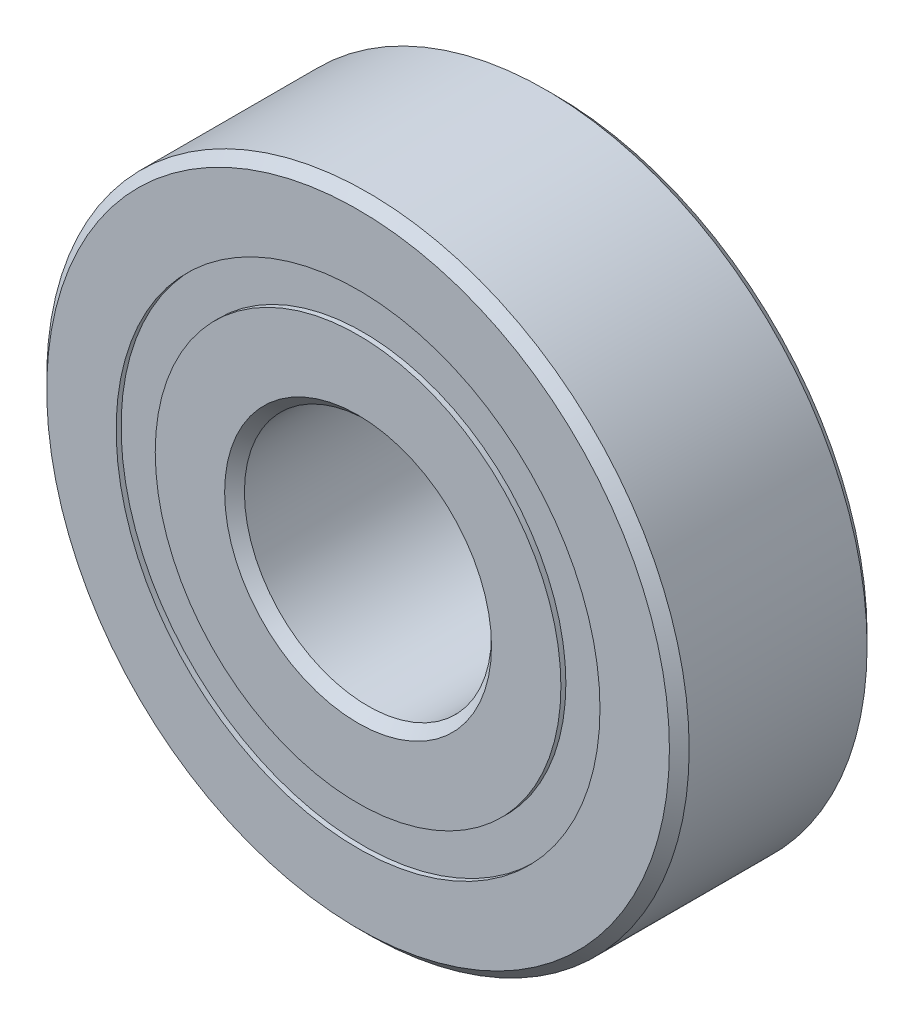
ISO-10303-21;
HEADER;
FILE_DESCRIPTION(('STEP AP214'),'2;1');
FILE_NAME('part.step','',(''),(''),'','','');
FILE_SCHEMA(('AUTOMOTIVE_DESIGN { 1 0 10303 214 1 1 1 1 }'));
ENDSEC;
DATA;
#1=APPLICATION_CONTEXT('core data for automotive mechanical design processes');
#2=APPLICATION_PROTOCOL_DEFINITION('international standard','automotive_design',2000,#1);
#3=PRODUCT_CONTEXT('',#1,'mechanical');
#4=PRODUCT('Part','Part','',(#3));
#5=PRODUCT_RELATED_PRODUCT_CATEGORY('part','',(#4));
#6=PRODUCT_DEFINITION_FORMATION('','',#4);
#7=PRODUCT_DEFINITION_CONTEXT('part definition',#1,'design');
#8=PRODUCT_DEFINITION('design','',#6,#7);
#9=PRODUCT_DEFINITION_SHAPE('','',#8);
#10=(LENGTH_UNIT() NAMED_UNIT(*) SI_UNIT(.MILLI.,.METRE.));
#11=(NAMED_UNIT(*) PLANE_ANGLE_UNIT() SI_UNIT($,.RADIAN.));
#12=(NAMED_UNIT(*) SI_UNIT($,.STERADIAN.) SOLID_ANGLE_UNIT());
#13=UNCERTAINTY_MEASURE_WITH_UNIT(LENGTH_MEASURE(1.E-05),#10,'distance_accuracy_value','');
#14=(GEOMETRIC_REPRESENTATION_CONTEXT(3) GLOBAL_UNCERTAINTY_ASSIGNED_CONTEXT((#13)) GLOBAL_UNIT_ASSIGNED_CONTEXT((#10,
#11,#12)) REPRESENTATION_CONTEXT('',''));
#15=CARTESIAN_POINT('',(0.,0.,0.));
#16=DIRECTION('',(0.,0.,1.));
#17=DIRECTION('',(1.,0.,0.));
#18=AXIS2_PLACEMENT_3D('',#15,#16,#17);
#19=CARTESIAN_POINT('',(0.,9.79,4.));
#20=DIRECTION('',(0.,0.,-1.));
#21=DIRECTION('',(-1.,0.,0.));
#22=AXIS2_PLACEMENT_3D('',#19,#20,#21);
#23=PLANE('',#22);
#24=CARTESIAN_POINT('',(0.,0.,4.));
#25=DIRECTION('',(0.,0.,1.));
#26=DIRECTION('',(1.,0.,0.));
#27=AXIS2_PLACEMENT_3D('',#24,#25,#26);
#28=CIRCLE('',#27,9.79);
#29=CARTESIAN_POINT('',(9.79,0.,4.));
#30=VERTEX_POINT('',#29);
#31=EDGE_CURVE('E11',#30,#30,#28,.T.);
#32=ORIENTED_EDGE('',*,*,#31,.F.);
#33=EDGE_LOOP('',(#32));
#34=FACE_BOUND('',#33,.T.);
#35=CARTESIAN_POINT('',(0.,0.,4.));
#36=DIRECTION('',(0.,0.,1.));
#37=DIRECTION('',(1.,0.,0.));
#38=AXIS2_PLACEMENT_3D('',#35,#36,#37);
#39=CIRCLE('',#38,12.6);
#40=CARTESIAN_POINT('',(12.6,0.,4.));
#41=VERTEX_POINT('',#40);
#42=EDGE_CURVE('E79',#41,#41,#39,.T.);
#43=ORIENTED_EDGE('',*,*,#42,.T.);
#44=EDGE_LOOP('',(#43));
#45=FACE_BOUND('',#44,.T.);
#46=ADVANCED_FACE('F39',(#34,#45),#23,.F.);
#47=CARTESIAN_POINT('',(0.,0.,4.));
#48=DIRECTION('',(0.,0.,1.));
#49=DIRECTION('',(1.,0.,0.));
#50=AXIS2_PLACEMENT_3D('',#47,#48,#49);
#51=CYLINDRICAL_SURFACE('',#50,9.79);
#52=CARTESIAN_POINT('',(0.,0.,3.8));
#53=DIRECTION('',(0.,0.,1.));
#54=DIRECTION('',(1.,0.,0.));
#55=AXIS2_PLACEMENT_3D('',#52,#53,#54);
#56=CIRCLE('',#55,9.79);
#57=CARTESIAN_POINT('',(9.79,0.,3.8));
#58=VERTEX_POINT('',#57);
#59=EDGE_CURVE('E45',#58,#58,#56,.T.);
#60=ORIENTED_EDGE('',*,*,#59,.F.);
#61=EDGE_LOOP('',(#60));
#62=FACE_BOUND('',#61,.T.);
#63=ORIENTED_EDGE('',*,*,#31,.T.);
#64=EDGE_LOOP('',(#63));
#65=FACE_BOUND('',#64,.T.);
#66=ADVANCED_FACE('F140',(#62,#65),#51,.F.);
#67=CARTESIAN_POINT('',(0.,8.21,3.8));
#68=DIRECTION('',(0.,0.,-1.));
#69=DIRECTION('',(-1.,0.,0.));
#70=AXIS2_PLACEMENT_3D('',#67,#68,#69);
#71=PLANE('',#70);
#72=CARTESIAN_POINT('',(0.,0.,3.8));
#73=DIRECTION('',(0.,0.,1.));
#74=DIRECTION('',(1.,0.,0.));
#75=AXIS2_PLACEMENT_3D('',#72,#73,#74);
#76=CIRCLE('',#75,8.21);
#77=CARTESIAN_POINT('',(8.21,0.,3.8));
#78=VERTEX_POINT('',#77);
#79=EDGE_CURVE('E49',#78,#78,#76,.T.);
#80=ORIENTED_EDGE('',*,*,#79,.F.);
#81=EDGE_LOOP('',(#80));
#82=FACE_BOUND('',#81,.T.);
#83=ORIENTED_EDGE('',*,*,#59,.T.);
#84=EDGE_LOOP('',(#83));
#85=FACE_BOUND('',#84,.T.);
#86=ADVANCED_FACE('F135',(#82,#85),#71,.F.);
#87=CARTESIAN_POINT('',(0.,0.,4.));
#88=DIRECTION('',(0.,0.,1.));
#89=DIRECTION('',(1.,0.,0.));
#90=AXIS2_PLACEMENT_3D('',#87,#88,#89);
#91=CYLINDRICAL_SURFACE('',#90,8.21);
#92=CARTESIAN_POINT('',(0.,0.,1.94589444175334));
#93=DIRECTION('',(0.,0.,1.));
#94=DIRECTION('',(1.,0.,0.));
#95=AXIS2_PLACEMENT_3D('',#92,#93,#94);
#96=CIRCLE('',#95,8.21);
#97=CARTESIAN_POINT('',(8.21,0.,1.94589444175334));
#98=VERTEX_POINT('',#97);
#99=EDGE_CURVE('E53',#98,#98,#96,.T.);
#100=ORIENTED_EDGE('',*,*,#99,.F.);
#101=EDGE_LOOP('',(#100));
#102=FACE_BOUND('',#101,.T.);
#103=ORIENTED_EDGE('',*,*,#79,.T.);
#104=EDGE_LOOP('',(#103));
#105=FACE_BOUND('',#104,.T.);
#106=ADVANCED_FACE('F129',(#102,#105),#91,.F.);
#107=CARTESIAN_POINT('',(0.,9.12647063514285,1.94589444175334));
#108=DIRECTION('',(0.,0.,1.));
#109=DIRECTION('',(1.,0.,0.));
#110=AXIS2_PLACEMENT_3D('',#107,#108,#109);
#111=PLANE('',#110);
#112=CARTESIAN_POINT('',(0.,0.,1.94589444175334));
#113=DIRECTION('',(0.,0.,1.));
#114=DIRECTION('',(1.,0.,0.));
#115=AXIS2_PLACEMENT_3D('',#112,#113,#114);
#116=CIRCLE('',#115,9.12647063514285);
#117=CARTESIAN_POINT('',(9.12647063514285,0.,1.94589444175334));
#118=VERTEX_POINT('',#117);
#119=EDGE_CURVE('E58',#118,#118,#116,.T.);
#120=ORIENTED_EDGE('',*,*,#119,.F.);
#121=EDGE_LOOP('',(#120));
#122=FACE_BOUND('',#121,.T.);
#123=ORIENTED_EDGE('',*,*,#99,.T.);
#124=EDGE_LOOP('',(#123));
#125=FACE_BOUND('',#124,.T.);
#126=ADVANCED_FACE('F123',(#122,#125),#111,.F.);
#127=CARTESIAN_POINT('',(0.,0.,0.));
#128=DIRECTION('',(0.,0.,1.));
#129=DIRECTION('',(1.,0.,0.));
#130=AXIS2_PLACEMENT_3D('',#127,#128,#129);
#131=TOROIDAL_SURFACE('',#130,9.,1.95);
#132=CARTESIAN_POINT('',(0.,0.,-1.94589444175335));
#133=DIRECTION('',(0.,0.,1.));
#134=DIRECTION('',(1.,0.,0.));
#135=AXIS2_PLACEMENT_3D('',#132,#133,#134);
#136=CIRCLE('',#135,9.12647063514285);
#137=CARTESIAN_POINT('',(9.12647063514285,0.,-1.94589444175335));
#138=VERTEX_POINT('',#137);
#139=EDGE_CURVE('E61',#138,#138,#136,.T.);
#140=ORIENTED_EDGE('',*,*,#139,.F.);
#141=EDGE_LOOP('',(#140));
#142=FACE_BOUND('',#141,.T.);
#143=ORIENTED_EDGE('',*,*,#119,.T.);
#144=EDGE_LOOP('',(#143));
#145=FACE_BOUND('',#144,.T.);
#146=ADVANCED_FACE('F117',(#142,#145),#131,.F.);
#147=CARTESIAN_POINT('',(0.,9.12647063514285,-1.94589444175335));
#148=DIRECTION('',(0.,0.,-1.));
#149=DIRECTION('',(-1.,0.,0.));
#150=AXIS2_PLACEMENT_3D('',#147,#148,#149);
#151=PLANE('',#150);
#152=CARTESIAN_POINT('',(0.,0.,-1.94589444175335));
#153=DIRECTION('',(0.,0.,1.));
#154=DIRECTION('',(1.,0.,0.));
#155=AXIS2_PLACEMENT_3D('',#152,#153,#154);
#156=CIRCLE('',#155,8.21);
#157=CARTESIAN_POINT('',(8.21,0.,-1.94589444175335));
#158=VERTEX_POINT('',#157);
#159=EDGE_CURVE('E64',#158,#158,#156,.T.);
#160=ORIENTED_EDGE('',*,*,#159,.F.);
#161=EDGE_LOOP('',(#160));
#162=FACE_BOUND('',#161,.T.);
#163=ORIENTED_EDGE('',*,*,#139,.T.);
#164=EDGE_LOOP('',(#163));
#165=FACE_BOUND('',#164,.T.);
#166=ADVANCED_FACE('F111',(#162,#165),#151,.F.);
#167=CARTESIAN_POINT('',(0.,0.,4.));
#168=DIRECTION('',(0.,0.,1.));
#169=DIRECTION('',(1.,0.,0.));
#170=AXIS2_PLACEMENT_3D('',#167,#168,#169);
#171=CYLINDRICAL_SURFACE('',#170,8.21);
#172=CARTESIAN_POINT('',(0.,0.,-3.80000000000001));
#173=DIRECTION('',(0.,0.,1.));
#174=DIRECTION('',(1.,0.,0.));
#175=AXIS2_PLACEMENT_3D('',#172,#173,#174);
#176=CIRCLE('',#175,8.21);
#177=CARTESIAN_POINT('',(8.21,0.,-3.80000000000001));
#178=VERTEX_POINT('',#177);
#179=EDGE_CURVE('E67',#178,#178,#176,.T.);
#180=ORIENTED_EDGE('',*,*,#179,.F.);
#181=EDGE_LOOP('',(#180));
#182=FACE_BOUND('',#181,.T.);
#183=ORIENTED_EDGE('',*,*,#159,.T.);
#184=EDGE_LOOP('',(#183));
#185=FACE_BOUND('',#184,.T.);
#186=ADVANCED_FACE('F105',(#182,#185),#171,.F.);
#187=CARTESIAN_POINT('',(0.,8.21,-3.80000000000001));
#188=DIRECTION('',(0.,0.,1.));
#189=DIRECTION('',(1.,0.,0.));
#190=AXIS2_PLACEMENT_3D('',#187,#188,#189);
#191=PLANE('',#190);
#192=CARTESIAN_POINT('',(0.,0.,-3.80000000000001));
#193=DIRECTION('',(0.,0.,1.));
#194=DIRECTION('',(1.,0.,0.));
#195=AXIS2_PLACEMENT_3D('',#192,#193,#194);
#196=CIRCLE('',#195,9.79);
#197=CARTESIAN_POINT('',(9.79,0.,-3.80000000000001));
#198=VERTEX_POINT('',#197);
#199=EDGE_CURVE('E70',#198,#198,#196,.T.);
#200=ORIENTED_EDGE('',*,*,#199,.F.);
#201=EDGE_LOOP('',(#200));
#202=FACE_BOUND('',#201,.T.);
#203=ORIENTED_EDGE('',*,*,#179,.T.);
#204=EDGE_LOOP('',(#203));
#205=FACE_BOUND('',#204,.T.);
#206=ADVANCED_FACE('F99',(#202,#205),#191,.F.);
#207=CARTESIAN_POINT('',(0.,0.,4.));
#208=DIRECTION('',(0.,0.,1.));
#209=DIRECTION('',(1.,0.,0.));
#210=AXIS2_PLACEMENT_3D('',#207,#208,#209);
#211=CYLINDRICAL_SURFACE('',#210,9.79);
#212=CARTESIAN_POINT('',(0.,0.,-4.00000000000001));
#213=DIRECTION('',(0.,0.,1.));
#214=DIRECTION('',(1.,0.,0.));
#215=AXIS2_PLACEMENT_3D('',#212,#213,#214);
#216=CIRCLE('',#215,9.79);
#217=CARTESIAN_POINT('',(9.79,0.,-4.00000000000001));
#218=VERTEX_POINT('',#217);
#219=EDGE_CURVE('E73',#218,#218,#216,.T.);
#220=ORIENTED_EDGE('',*,*,#219,.F.);
#221=EDGE_LOOP('',(#220));
#222=FACE_BOUND('',#221,.T.);
#223=ORIENTED_EDGE('',*,*,#199,.T.);
#224=EDGE_LOOP('',(#223));
#225=FACE_BOUND('',#224,.T.);
#226=ADVANCED_FACE('F93',(#222,#225),#211,.F.);
#227=CARTESIAN_POINT('',(0.,9.79,-4.00000000000001));
#228=DIRECTION('',(0.,0.,1.));
#229=DIRECTION('',(1.,0.,0.));
#230=AXIS2_PLACEMENT_3D('',#227,#228,#229);
#231=PLANE('',#230);
#232=CARTESIAN_POINT('',(0.,0.,-4.00000000000001));
#233=DIRECTION('',(0.,0.,1.));
#234=DIRECTION('',(1.,0.,0.));
#235=AXIS2_PLACEMENT_3D('',#232,#233,#234);
#236=CIRCLE('',#235,12.6);
#237=CARTESIAN_POINT('',(12.6,0.,-4.00000000000001));
#238=VERTEX_POINT('',#237);
#239=EDGE_CURVE('E76',#238,#238,#236,.T.);
#240=ORIENTED_EDGE('',*,*,#239,.F.);
#241=EDGE_LOOP('',(#240));
#242=FACE_BOUND('',#241,.T.);
#243=ORIENTED_EDGE('',*,*,#219,.T.);
#244=EDGE_LOOP('',(#243));
#245=FACE_BOUND('',#244,.T.);
#246=ADVANCED_FACE('F87',(#242,#245),#231,.F.);
#247=CARTESIAN_POINT('',(0.,0.,4.));
#248=DIRECTION('',(0.,0.,1.));
#249=DIRECTION('',(1.,0.,0.));
#250=AXIS2_PLACEMENT_3D('',#247,#248,#249);
#251=CYLINDRICAL_SURFACE('',#250,12.6);
#252=ORIENTED_EDGE('',*,*,#42,.F.);
#253=EDGE_LOOP('',(#252));
#254=FACE_BOUND('',#253,.T.);
#255=ORIENTED_EDGE('',*,*,#239,.T.);
#256=EDGE_LOOP('',(#255));
#257=FACE_BOUND('',#256,.T.);
#258=ADVANCED_FACE('F84',(#254,#257),#251,.T.);
#259=CLOSED_SHELL('',(#46,#66,#86,#106,#126,#146,#166,#186,#206,#226,#246,#258));
#260=MANIFOLD_SOLID_BREP('B2',#259);
#261=CARTESIAN_POINT('',(-4.4999999999999,7.79422863406001,0.));
#262=DIRECTION('',(0.,0.,1.));
#263=DIRECTION('',(-0.499999999999989,0.866025403784445,0.));
#264=AXIS2_PLACEMENT_3D('',#261,#262,#263);
#265=SPHERICAL_SURFACE('',#264,1.94589444175335);
#266=CARTESIAN_POINT('',(-4.4999999999999,7.79422863406001,1.94589444175334));
#267=VERTEX_POINT('',#266);
#268=VERTEX_LOOP('',#267);
#269=FACE_BOUND('',#268,.T.);
#270=ADVANCED_FACE('F226',(#269),#265,.T.);
#271=CLOSED_SHELL('',(#270));
#272=MANIFOLD_SOLID_BREP('B6',#271);
#273=CARTESIAN_POINT('',(-7.7942286340599,4.50000000000009,0.));
#274=DIRECTION('',(0.,0.,1.));
#275=DIRECTION('',(-0.866025403784433,0.50000000000001,0.));
#276=AXIS2_PLACEMENT_3D('',#273,#274,#275);
#277=SPHERICAL_SURFACE('',#276,1.94589444175335);
#278=CARTESIAN_POINT('',(-7.7942286340599,4.50000000000009,1.94589444175334));
#279=VERTEX_POINT('',#278);
#280=VERTEX_LOOP('',#279);
#281=FACE_BOUND('',#280,.T.);
#282=ADVANCED_FACE('F246',(#281),#277,.T.);
#283=CLOSED_SHELL('',(#282));
#284=MANIFOLD_SOLID_BREP('B35',#283);
#285=CARTESIAN_POINT('',(-9.,0.,0.));
#286=DIRECTION('',(0.,0.,1.));
#287=DIRECTION('',(-1.,0.,0.));
#288=AXIS2_PLACEMENT_3D('',#285,#286,#287);
#289=SPHERICAL_SURFACE('',#288,1.94589444175335);
#290=CARTESIAN_POINT('',(-9.,0.,1.94589444175334));
#291=VERTEX_POINT('',#290);
#292=VERTEX_LOOP('',#291);
#293=FACE_BOUND('',#292,.T.);
#294=ADVANCED_FACE('F266',(#293),#289,.T.);
#295=CLOSED_SHELL('',(#294));
#296=MANIFOLD_SOLID_BREP('B222',#295);
#297=CARTESIAN_POINT('',(-7.79422863405999,-4.49999999999993,0.));
#298=DIRECTION('',(0.,0.,1.));
#299=DIRECTION('',(-0.866025403784443,-0.499999999999992,0.));
#300=AXIS2_PLACEMENT_3D('',#297,#298,#299);
#301=SPHERICAL_SURFACE('',#300,1.94589444175335);
#302=CARTESIAN_POINT('',(-7.79422863405999,-4.49999999999993,1.94589444175334));
#303=VERTEX_POINT('',#302);
#304=VERTEX_LOOP('',#303);
#305=FACE_BOUND('',#304,.T.);
#306=ADVANCED_FACE('F286',(#305),#301,.T.);
#307=CLOSED_SHELL('',(#306));
#308=MANIFOLD_SOLID_BREP('B242',#307);
#309=CARTESIAN_POINT('',(-4.50000000000006,-7.79422863405991,0.));
#310=DIRECTION('',(0.,0.,1.));
#311=DIRECTION('',(-0.500000000000007,-0.866025403784435,0.));
#312=AXIS2_PLACEMENT_3D('',#309,#310,#311);
#313=SPHERICAL_SURFACE('',#312,1.94589444175335);
#314=CARTESIAN_POINT('',(-4.50000000000006,-7.79422863405991,1.94589444175334));
#315=VERTEX_POINT('',#314);
#316=VERTEX_LOOP('',#315);
#317=FACE_BOUND('',#316,.T.);
#318=ADVANCED_FACE('F306',(#317),#313,.T.);
#319=CLOSED_SHELL('',(#318));
#320=MANIFOLD_SOLID_BREP('B262',#319);
#321=CARTESIAN_POINT('',(0.,-9.,0.));
#322=DIRECTION('',(0.,0.,1.));
#323=DIRECTION('',(0.,-1.,0.));
#324=AXIS2_PLACEMENT_3D('',#321,#322,#323);
#325=SPHERICAL_SURFACE('',#324,1.94589444175335);
#326=CARTESIAN_POINT('',(0.,-9.,1.94589444175334));
#327=VERTEX_POINT('',#326);
#328=VERTEX_LOOP('',#327);
#329=FACE_BOUND('',#328,.T.);
#330=ADVANCED_FACE('F326',(#329),#325,.T.);
#331=CLOSED_SHELL('',(#330));
#332=MANIFOLD_SOLID_BREP('B282',#331);
#333=CARTESIAN_POINT('',(4.49999999999996,-7.79422863405997,0.));
#334=DIRECTION('',(0.,0.,1.));
#335=DIRECTION('',(0.499999999999995,-0.866025403784442,0.));
#336=AXIS2_PLACEMENT_3D('',#333,#334,#335);
#337=SPHERICAL_SURFACE('',#336,1.94589444175335);
#338=CARTESIAN_POINT('',(4.49999999999996,-7.79422863405997,1.94589444175334));
#339=VERTEX_POINT('',#338);
#340=VERTEX_LOOP('',#339);
#341=FACE_BOUND('',#340,.T.);
#342=ADVANCED_FACE('F346',(#341),#337,.T.);
#343=CLOSED_SHELL('',(#342));
#344=MANIFOLD_SOLID_BREP('B302',#343);
#345=CARTESIAN_POINT('',(7.79422863405993,-4.50000000000004,0.));
#346=DIRECTION('',(0.,0.,1.));
#347=DIRECTION('',(0.866025403784436,-0.500000000000004,0.));
#348=AXIS2_PLACEMENT_3D('',#345,#346,#347);
#349=SPHERICAL_SURFACE('',#348,1.94589444175335);
#350=CARTESIAN_POINT('',(7.79422863405993,-4.50000000000004,1.94589444175334));
#351=VERTEX_POINT('',#350);
#352=VERTEX_LOOP('',#351);
#353=FACE_BOUND('',#352,.T.);
#354=ADVANCED_FACE('F366',(#353),#349,.T.);
#355=CLOSED_SHELL('',(#354));
#356=MANIFOLD_SOLID_BREP('B322',#355);
#357=CARTESIAN_POINT('',(9.,0.,0.));
#358=DIRECTION('',(0.,0.,1.));
#359=DIRECTION('',(1.,0.,0.));
#360=AXIS2_PLACEMENT_3D('',#357,#358,#359);
#361=SPHERICAL_SURFACE('',#360,1.94589444175335);
#362=CARTESIAN_POINT('',(9.,0.,1.94589444175334));
#363=VERTEX_POINT('',#362);
#364=VERTEX_LOOP('',#363);
#365=FACE_BOUND('',#364,.T.);
#366=ADVANCED_FACE('F386',(#365),#361,.T.);
#367=CLOSED_SHELL('',(#366));
#368=MANIFOLD_SOLID_BREP('B342',#367);
#369=CARTESIAN_POINT('',(7.79422863405996,4.49999999999998,0.));
#370=DIRECTION('',(0.,0.,1.));
#371=DIRECTION('',(0.86602540378444,0.499999999999998,0.));
#372=AXIS2_PLACEMENT_3D('',#369,#370,#371);
#373=SPHERICAL_SURFACE('',#372,1.94589444175335);
#374=CARTESIAN_POINT('',(7.79422863405996,4.49999999999998,1.94589444175334));
#375=VERTEX_POINT('',#374);
#376=VERTEX_LOOP('',#375);
#377=FACE_BOUND('',#376,.T.);
#378=ADVANCED_FACE('F406',(#377),#373,.T.);
#379=CLOSED_SHELL('',(#378));
#380=MANIFOLD_SOLID_BREP('B362',#379);
#381=CARTESIAN_POINT('',(4.50000000000001,7.79422863405994,0.));
#382=DIRECTION('',(0.,0.,1.));
#383=DIRECTION('',(0.500000000000001,0.866025403784438,0.));
#384=AXIS2_PLACEMENT_3D('',#381,#382,#383);
#385=SPHERICAL_SURFACE('',#384,1.94589444175335);
#386=CARTESIAN_POINT('',(4.50000000000001,7.79422863405994,1.94589444175334));
#387=VERTEX_POINT('',#386);
#388=VERTEX_LOOP('',#387);
#389=FACE_BOUND('',#388,.T.);
#390=ADVANCED_FACE('F426',(#389),#385,.T.);
#391=CLOSED_SHELL('',(#390));
#392=MANIFOLD_SOLID_BREP('B382',#391);
#393=CARTESIAN_POINT('',(0.,9.,0.));
#394=DIRECTION('',(0.,0.,1.));
#395=DIRECTION('',(0.,1.,0.));
#396=AXIS2_PLACEMENT_3D('',#393,#394,#395);
#397=SPHERICAL_SURFACE('',#396,1.94589444175335);
#398=CARTESIAN_POINT('',(0.,9.,1.94589444175334));
#399=VERTEX_POINT('',#398);
#400=VERTEX_LOOP('',#399);
#401=FACE_BOUND('',#400,.T.);
#402=ADVANCED_FACE('F448',(#401),#397,.T.);
#403=CLOSED_SHELL('',(#402));
#404=MANIFOLD_SOLID_BREP('B402',#403);
#405=CARTESIAN_POINT('',(0.,0.,4.));
#406=DIRECTION('',(0.,0.,1.));
#407=DIRECTION('',(1.,0.,0.));
#408=AXIS2_PLACEMENT_3D('',#405,#406,#407);
#409=CYLINDRICAL_SURFACE('',#408,8.20879120879121);
#410=CARTESIAN_POINT('',(0.,0.,-1.77777777777778));
#411=DIRECTION('',(0.,0.,1.));
#412=DIRECTION('',(1.,0.,0.));
#413=AXIS2_PLACEMENT_3D('',#410,#411,#412);
#414=CIRCLE('',#413,8.20879120879121);
#415=CARTESIAN_POINT('',(8.20879120879121,0.,-1.77777777777778));
#416=VERTEX_POINT('',#415);
#417=EDGE_CURVE('E447',#416,#416,#414,.T.);
#418=ORIENTED_EDGE('',*,*,#417,.F.);
#419=EDGE_LOOP('',(#418));
#420=FACE_BOUND('',#419,.T.);
#421=CARTESIAN_POINT('',(0.,0.,-4.00000000000001));
#422=DIRECTION('',(0.,0.,1.));
#423=DIRECTION('',(1.,0.,0.));
#424=AXIS2_PLACEMENT_3D('',#421,#422,#423);
#425=CIRCLE('',#424,8.20879120879121);
#426=CARTESIAN_POINT('',(8.20879120879121,0.,-4.00000000000001));
#427=VERTEX_POINT('',#426);
#428=EDGE_CURVE('E495',#427,#427,#425,.T.);
#429=ORIENTED_EDGE('',*,*,#428,.T.);
#430=EDGE_LOOP('',(#429));
#431=FACE_BOUND('',#430,.T.);
#432=ADVANCED_FACE('F467',(#420,#431),#409,.T.);
#433=CARTESIAN_POINT('',(0.,0.,0.));
#434=DIRECTION('',(0.,0.,1.));
#435=DIRECTION('',(1.,0.,0.));
#436=AXIS2_PLACEMENT_3D('',#433,#434,#435);
#437=TOROIDAL_SURFACE('',#436,9.,1.94589444175335);
#438=CARTESIAN_POINT('',(0.,0.,1.77777777777777));
#439=DIRECTION('',(0.,0.,1.));
#440=DIRECTION('',(1.,0.,0.));
#441=AXIS2_PLACEMENT_3D('',#438,#439,#440);
#442=CIRCLE('',#441,8.20879120879121);
#443=CARTESIAN_POINT('',(8.20879120879121,0.,1.77777777777777));
#444=VERTEX_POINT('',#443);
#445=EDGE_CURVE('E473',#444,#444,#442,.T.);
#446=ORIENTED_EDGE('',*,*,#445,.F.);
#447=EDGE_LOOP('',(#446));
#448=FACE_BOUND('',#447,.T.);
#449=ORIENTED_EDGE('',*,*,#417,.T.);
#450=EDGE_LOOP('',(#449));
#451=FACE_BOUND('',#450,.T.);
#452=ADVANCED_FACE('F532',(#448,#451),#437,.F.);
#453=CARTESIAN_POINT('',(0.,0.,4.));
#454=DIRECTION('',(0.,0.,1.));
#455=DIRECTION('',(1.,0.,0.));
#456=AXIS2_PLACEMENT_3D('',#453,#454,#455);
#457=CYLINDRICAL_SURFACE('',#456,8.20879120879121);
#458=CARTESIAN_POINT('',(0.,0.,4.));
#459=DIRECTION('',(0.,0.,1.));
#460=DIRECTION('',(1.,0.,0.));
#461=AXIS2_PLACEMENT_3D('',#458,#459,#460);
#462=CIRCLE('',#461,8.20879120879121);
#463=CARTESIAN_POINT('',(8.20879120879121,0.,4.));
#464=VERTEX_POINT('',#463);
#465=EDGE_CURVE('E477',#464,#464,#462,.T.);
#466=ORIENTED_EDGE('',*,*,#465,.F.);
#467=EDGE_LOOP('',(#466));
#468=FACE_BOUND('',#467,.T.);
#469=ORIENTED_EDGE('',*,*,#445,.T.);
#470=EDGE_LOOP('',(#469));
#471=FACE_BOUND('',#470,.T.);
#472=ADVANCED_FACE('F527',(#468,#471),#457,.T.);
#473=CARTESIAN_POINT('',(0.,5.4,4.00000000000001));
#474=DIRECTION('',(0.,0.,-1.));
#475=DIRECTION('',(-1.,0.,0.));
#476=AXIS2_PLACEMENT_3D('',#473,#474,#475);
#477=PLANE('',#476);
#478=CARTESIAN_POINT('',(0.,0.,4.00000000000001));
#479=DIRECTION('',(0.,0.,1.));
#480=DIRECTION('',(1.,0.,0.));
#481=AXIS2_PLACEMENT_3D('',#478,#479,#480);
#482=CIRCLE('',#481,5.4);
#483=CARTESIAN_POINT('',(5.4,0.,4.00000000000001));
#484=VERTEX_POINT('',#483);
#485=EDGE_CURVE('E481',#484,#484,#482,.T.);
#486=ORIENTED_EDGE('',*,*,#485,.F.);
#487=EDGE_LOOP('',(#486));
#488=FACE_BOUND('',#487,.T.);
#489=ORIENTED_EDGE('',*,*,#465,.T.);
#490=EDGE_LOOP('',(#489));
#491=FACE_BOUND('',#490,.T.);
#492=ADVANCED_FACE('F521',(#488,#491),#477,.F.);
#493=CARTESIAN_POINT('',(0.,0.,4.00000000000001));
#494=DIRECTION('',(0.,0.,1.));
#495=DIRECTION('',(1.,0.,0.));
#496=AXIS2_PLACEMENT_3D('',#493,#494,#495);
#497=CONICAL_SURFACE('',#496,5.4,0.785398163397453);
#498=CARTESIAN_POINT('',(0.,0.,3.60000000000001));
#499=DIRECTION('',(0.,0.,1.));
#500=DIRECTION('',(1.,0.,0.));
#501=AXIS2_PLACEMENT_3D('',#498,#499,#500);
#502=CIRCLE('',#501,5.);
#503=CARTESIAN_POINT('',(5.,0.,3.60000000000001));
#504=VERTEX_POINT('',#503);
#505=EDGE_CURVE('E486',#504,#504,#502,.T.);
#506=ORIENTED_EDGE('',*,*,#505,.F.);
#507=EDGE_LOOP('',(#506));
#508=FACE_BOUND('',#507,.T.);
#509=ORIENTED_EDGE('',*,*,#485,.T.);
#510=EDGE_LOOP('',(#509));
#511=FACE_BOUND('',#510,.T.);
#512=ADVANCED_FACE('F515',(#508,#511),#497,.F.);
#513=CARTESIAN_POINT('',(0.,0.,4.));
#514=DIRECTION('',(0.,0.,1.));
#515=DIRECTION('',(1.,0.,0.));
#516=AXIS2_PLACEMENT_3D('',#513,#514,#515);
#517=CYLINDRICAL_SURFACE('',#516,5.);
#518=CARTESIAN_POINT('',(0.,0.,-3.60000000000001));
#519=DIRECTION('',(0.,0.,1.));
#520=DIRECTION('',(1.,0.,0.));
#521=AXIS2_PLACEMENT_3D('',#518,#519,#520);
#522=CIRCLE('',#521,5.);
#523=CARTESIAN_POINT('',(5.,0.,-3.60000000000001));
#524=VERTEX_POINT('',#523);
#525=EDGE_CURVE('E489',#524,#524,#522,.T.);
#526=ORIENTED_EDGE('',*,*,#525,.F.);
#527=EDGE_LOOP('',(#526));
#528=FACE_BOUND('',#527,.T.);
#529=ORIENTED_EDGE('',*,*,#505,.T.);
#530=EDGE_LOOP('',(#529));
#531=FACE_BOUND('',#530,.T.);
#532=ADVANCED_FACE('F509',(#528,#531),#517,.F.);
#533=CARTESIAN_POINT('',(0.,0.,-3.60000000000001));
#534=DIRECTION('',(0.,0.,-1.));
#535=DIRECTION('',(-1.,0.,0.));
#536=AXIS2_PLACEMENT_3D('',#533,#534,#535);
#537=CONICAL_SURFACE('',#536,5.,0.785398163397446);
#538=CARTESIAN_POINT('',(0.,0.,-4.00000000000001));
#539=DIRECTION('',(0.,0.,1.));
#540=DIRECTION('',(1.,0.,0.));
#541=AXIS2_PLACEMENT_3D('',#538,#539,#540);
#542=CIRCLE('',#541,5.4);
#543=CARTESIAN_POINT('',(5.4,0.,-4.00000000000001));
#544=VERTEX_POINT('',#543);
#545=EDGE_CURVE('E492',#544,#544,#542,.T.);
#546=ORIENTED_EDGE('',*,*,#545,.F.);
#547=EDGE_LOOP('',(#546));
#548=FACE_BOUND('',#547,.T.);
#549=ORIENTED_EDGE('',*,*,#525,.T.);
#550=EDGE_LOOP('',(#549));
#551=FACE_BOUND('',#550,.T.);
#552=ADVANCED_FACE('F503',(#548,#551),#537,.F.);
#553=CARTESIAN_POINT('',(0.,5.4,-4.00000000000001));
#554=DIRECTION('',(0.,0.,1.));
#555=DIRECTION('',(1.,0.,0.));
#556=AXIS2_PLACEMENT_3D('',#553,#554,#555);
#557=PLANE('',#556);
#558=ORIENTED_EDGE('',*,*,#428,.F.);
#559=EDGE_LOOP('',(#558));
#560=FACE_BOUND('',#559,.T.);
#561=ORIENTED_EDGE('',*,*,#545,.T.);
#562=EDGE_LOOP('',(#561));
#563=FACE_BOUND('',#562,.T.);
#564=ADVANCED_FACE('F500',(#560,#563),#557,.F.);
#565=CLOSED_SHELL('',(#432,#452,#472,#492,#512,#532,#552,#564));
#566=MANIFOLD_SOLID_BREP('B422',#565);
#567=CARTESIAN_POINT('',(0.,0.,3.6));
#568=DIRECTION('',(0.,0.,-1.));
#569=DIRECTION('',(-1.,0.,0.));
#570=AXIS2_PLACEMENT_3D('',#567,#568,#569);
#571=CONICAL_SURFACE('',#570,13.,0.785398163397446);
#572=CARTESIAN_POINT('',(0.,0.,4.));
#573=DIRECTION('',(0.,0.,1.));
#574=DIRECTION('',(1.,0.,0.));
#575=AXIS2_PLACEMENT_3D('',#572,#573,#574);
#576=CIRCLE('',#575,12.6);
#577=CARTESIAN_POINT('',(12.6,0.,4.));
#578=VERTEX_POINT('',#577);
#579=EDGE_CURVE('E616',#578,#578,#576,.T.);
#580=ORIENTED_EDGE('',*,*,#579,.F.);
#581=EDGE_LOOP('',(#580));
#582=FACE_BOUND('',#581,.T.);
#583=CARTESIAN_POINT('',(0.,0.,3.6));
#584=DIRECTION('',(0.,0.,1.));
#585=DIRECTION('',(1.,0.,0.));
#586=AXIS2_PLACEMENT_3D('',#583,#584,#585);
#587=CIRCLE('',#586,13.);
#588=CARTESIAN_POINT('',(13.,0.,3.6));
#589=VERTEX_POINT('',#588);
#590=EDGE_CURVE('E466',#589,#589,#587,.T.);
#591=ORIENTED_EDGE('',*,*,#590,.T.);
#592=EDGE_LOOP('',(#591));
#593=FACE_BOUND('',#592,.T.);
#594=ADVANCED_FACE('F588',(#582,#593),#571,.T.);
#595=CARTESIAN_POINT('',(0.,0.,4.));
#596=DIRECTION('',(0.,0.,1.));
#597=DIRECTION('',(1.,0.,0.));
#598=AXIS2_PLACEMENT_3D('',#595,#596,#597);
#599=CYLINDRICAL_SURFACE('',#598,13.);
#600=ORIENTED_EDGE('',*,*,#590,.F.);
#601=EDGE_LOOP('',(#600));
#602=FACE_BOUND('',#601,.T.);
#603=CARTESIAN_POINT('',(0.,0.,-3.60000000000001));
#604=DIRECTION('',(0.,0.,1.));
#605=DIRECTION('',(1.,0.,0.));
#606=AXIS2_PLACEMENT_3D('',#603,#604,#605);
#607=CIRCLE('',#606,13.);
#608=CARTESIAN_POINT('',(13.,0.,-3.60000000000001));
#609=VERTEX_POINT('',#608);
#610=EDGE_CURVE('E594',#609,#609,#607,.T.);
#611=ORIENTED_EDGE('',*,*,#610,.T.);
#612=EDGE_LOOP('',(#611));
#613=FACE_BOUND('',#612,.T.);
#614=ADVANCED_FACE('F623',(#602,#613),#599,.T.);
#615=CARTESIAN_POINT('',(0.,0.,-4.00000000000001));
#616=DIRECTION('',(0.,0.,1.));
#617=DIRECTION('',(1.,0.,0.));
#618=AXIS2_PLACEMENT_3D('',#615,#616,#617);
#619=CONICAL_SURFACE('',#618,12.6,0.785398163397446);
#620=ORIENTED_EDGE('',*,*,#610,.F.);
#621=EDGE_LOOP('',(#620));
#622=FACE_BOUND('',#621,.T.);
#623=CARTESIAN_POINT('',(0.,0.,-4.00000000000001));
#624=DIRECTION('',(0.,0.,1.));
#625=DIRECTION('',(1.,0.,0.));
#626=AXIS2_PLACEMENT_3D('',#623,#624,#625);
#627=CIRCLE('',#626,12.6);
#628=CARTESIAN_POINT('',(12.6,0.,-4.00000000000001));
#629=VERTEX_POINT('',#628);
#630=EDGE_CURVE('E598',#629,#629,#627,.T.);
#631=ORIENTED_EDGE('',*,*,#630,.T.);
#632=EDGE_LOOP('',(#631));
#633=FACE_BOUND('',#632,.T.);
#634=ADVANCED_FACE('F627',(#622,#633),#619,.T.);
#635=CARTESIAN_POINT('',(0.,0.,4.));
#636=DIRECTION('',(0.,0.,1.));
#637=DIRECTION('',(1.,0.,0.));
#638=AXIS2_PLACEMENT_3D('',#635,#636,#637);
#639=CYLINDRICAL_SURFACE('',#638,12.6);
#640=ORIENTED_EDGE('',*,*,#630,.F.);
#641=EDGE_LOOP('',(#640));
#642=FACE_BOUND('',#641,.T.);
#643=CARTESIAN_POINT('',(0.,0.,-1.77777777777778));
#644=DIRECTION('',(0.,0.,1.));
#645=DIRECTION('',(1.,0.,0.));
#646=AXIS2_PLACEMENT_3D('',#643,#644,#645);
#647=CIRCLE('',#646,12.6);
#648=CARTESIAN_POINT('',(12.6,0.,-1.77777777777778));
#649=VERTEX_POINT('',#648);
#650=EDGE_CURVE('E602',#649,#649,#647,.T.);
#651=ORIENTED_EDGE('',*,*,#650,.T.);
#652=EDGE_LOOP('',(#651));
#653=FACE_BOUND('',#652,.T.);
#654=ADVANCED_FACE('F632',(#642,#653),#639,.F.);
#655=CARTESIAN_POINT('',(0.,9.79120879120879,-1.77777777777778));
#656=DIRECTION('',(0.,0.,1.));
#657=DIRECTION('',(1.,0.,0.));
#658=AXIS2_PLACEMENT_3D('',#655,#656,#657);
#659=PLANE('',#658);
#660=ORIENTED_EDGE('',*,*,#650,.F.);
#661=EDGE_LOOP('',(#660));
#662=FACE_BOUND('',#661,.T.);
#663=CARTESIAN_POINT('',(0.,0.,-1.77777777777778));
#664=DIRECTION('',(0.,0.,1.));
#665=DIRECTION('',(1.,0.,0.));
#666=AXIS2_PLACEMENT_3D('',#663,#664,#665);
#667=CIRCLE('',#666,9.79120879120879);
#668=CARTESIAN_POINT('',(9.79120879120879,0.,-1.77777777777778));
#669=VERTEX_POINT('',#668);
#670=EDGE_CURVE('E607',#669,#669,#667,.T.);
#671=ORIENTED_EDGE('',*,*,#670,.T.);
#672=EDGE_LOOP('',(#671));
#673=FACE_BOUND('',#672,.T.);
#674=ADVANCED_FACE('F638',(#662,#673),#659,.F.);
#675=CARTESIAN_POINT('',(0.,0.,0.));
#676=DIRECTION('',(0.,0.,1.));
#677=DIRECTION('',(1.,0.,0.));
#678=AXIS2_PLACEMENT_3D('',#675,#676,#677);
#679=TOROIDAL_SURFACE('',#678,9.,1.94589444175335);
#680=ORIENTED_EDGE('',*,*,#670,.F.);
#681=EDGE_LOOP('',(#680));
#682=FACE_BOUND('',#681,.T.);
#683=CARTESIAN_POINT('',(0.,0.,1.77777777777777));
#684=DIRECTION('',(0.,0.,1.));
#685=DIRECTION('',(1.,0.,0.));
#686=AXIS2_PLACEMENT_3D('',#683,#684,#685);
#687=CIRCLE('',#686,9.79120879120879);
#688=CARTESIAN_POINT('',(9.79120879120879,0.,1.77777777777777));
#689=VERTEX_POINT('',#688);
#690=EDGE_CURVE('E610',#689,#689,#687,.T.);
#691=ORIENTED_EDGE('',*,*,#690,.T.);
#692=EDGE_LOOP('',(#691));
#693=FACE_BOUND('',#692,.T.);
#694=ADVANCED_FACE('F642',(#682,#693),#679,.F.);
#695=CARTESIAN_POINT('',(0.,9.79120879120879,1.77777777777777));
#696=DIRECTION('',(0.,0.,-1.));
#697=DIRECTION('',(-1.,0.,0.));
#698=AXIS2_PLACEMENT_3D('',#695,#696,#697);
#699=PLANE('',#698);
#700=ORIENTED_EDGE('',*,*,#690,.F.);
#701=EDGE_LOOP('',(#700));
#702=FACE_BOUND('',#701,.T.);
#703=CARTESIAN_POINT('',(0.,0.,1.77777777777777));
#704=DIRECTION('',(0.,0.,1.));
#705=DIRECTION('',(1.,0.,0.));
#706=AXIS2_PLACEMENT_3D('',#703,#704,#705);
#707=CIRCLE('',#706,12.6);
#708=CARTESIAN_POINT('',(12.6,0.,1.77777777777777));
#709=VERTEX_POINT('',#708);
#710=EDGE_CURVE('E613',#709,#709,#707,.T.);
#711=ORIENTED_EDGE('',*,*,#710,.T.);
#712=EDGE_LOOP('',(#711));
#713=FACE_BOUND('',#712,.T.);
#714=ADVANCED_FACE('F646',(#702,#713),#699,.F.);
#715=CARTESIAN_POINT('',(0.,0.,4.));
#716=DIRECTION('',(0.,0.,1.));
#717=DIRECTION('',(1.,0.,0.));
#718=AXIS2_PLACEMENT_3D('',#715,#716,#717);
#719=CYLINDRICAL_SURFACE('',#718,12.6);
#720=ORIENTED_EDGE('',*,*,#710,.F.);
#721=EDGE_LOOP('',(#720));
#722=FACE_BOUND('',#721,.T.);
#723=ORIENTED_EDGE('',*,*,#579,.T.);
#724=EDGE_LOOP('',(#723));
#725=FACE_BOUND('',#724,.T.);
#726=ADVANCED_FACE('F620',(#722,#725),#719,.F.);
#727=CLOSED_SHELL('',(#594,#614,#634,#654,#674,#694,#714,#726));
#728=MANIFOLD_SOLID_BREP('B442',#727);
#729=ADVANCED_BREP_SHAPE_REPRESENTATION('',(#18,#260,#272,#284,#296,#308,#320,#332,#344,#356,
#368,#380,#392,#404,#566,#728),#14);
#730=SHAPE_DEFINITION_REPRESENTATION(#9,#729);
ENDSEC;
END-ISO-10303-21;
